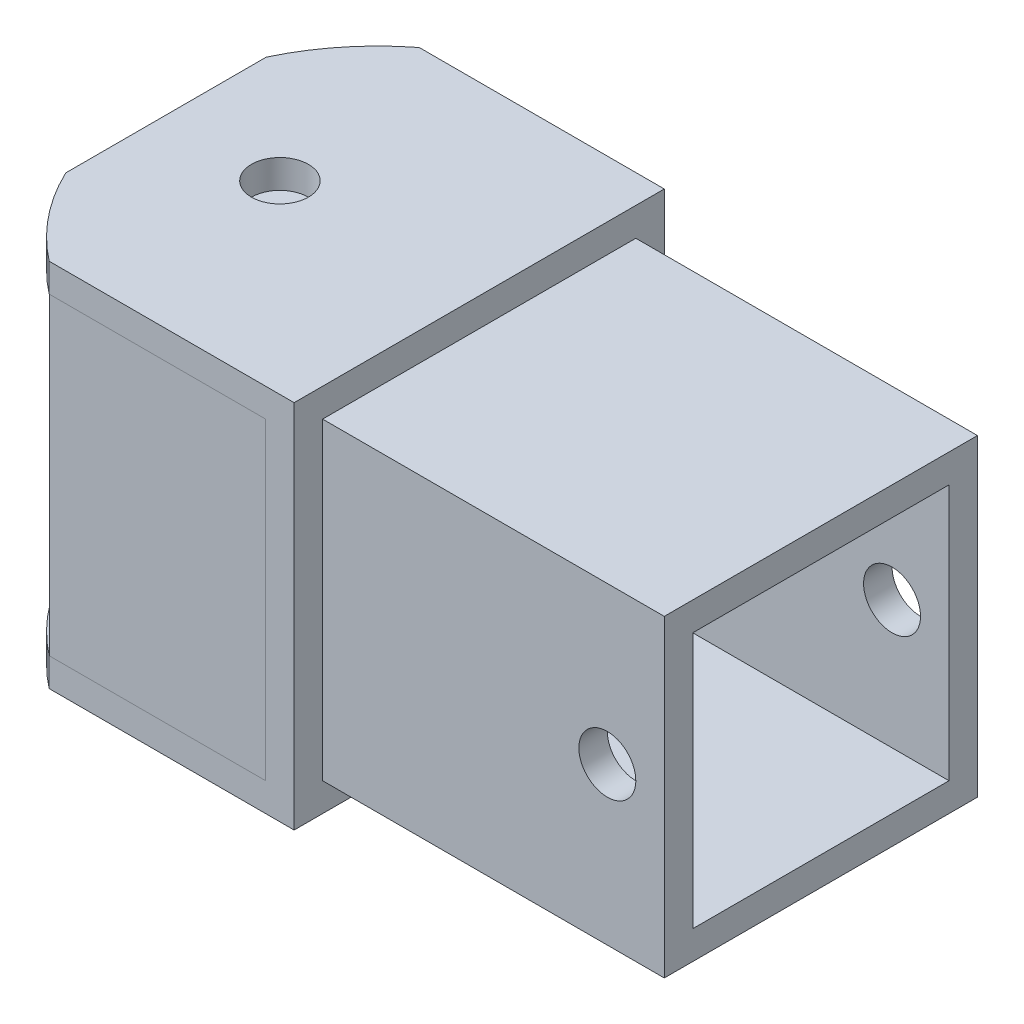
ISO-10303-21;
HEADER;
FILE_DESCRIPTION(('STEP AP214'),'2;1');
FILE_NAME('part.step','',(''),(''),'','','');
FILE_SCHEMA(('AUTOMOTIVE_DESIGN { 1 0 10303 214 1 1 1 1 }'));
ENDSEC;
DATA;
#1=APPLICATION_CONTEXT('core data for automotive mechanical design processes');
#2=APPLICATION_PROTOCOL_DEFINITION('international standard','automotive_design',2000,#1);
#3=PRODUCT_CONTEXT('',#1,'mechanical');
#4=PRODUCT('Part','Part','',(#3));
#5=PRODUCT_RELATED_PRODUCT_CATEGORY('part','',(#4));
#6=PRODUCT_DEFINITION_FORMATION('','',#4);
#7=PRODUCT_DEFINITION_CONTEXT('part definition',#1,'design');
#8=PRODUCT_DEFINITION('design','',#6,#7);
#9=PRODUCT_DEFINITION_SHAPE('','',#8);
#10=(LENGTH_UNIT() NAMED_UNIT(*) SI_UNIT(.MILLI.,.METRE.));
#11=(NAMED_UNIT(*) PLANE_ANGLE_UNIT() SI_UNIT($,.RADIAN.));
#12=(NAMED_UNIT(*) SI_UNIT($,.STERADIAN.) SOLID_ANGLE_UNIT());
#13=UNCERTAINTY_MEASURE_WITH_UNIT(LENGTH_MEASURE(1.E-05),#10,'distance_accuracy_value','');
#14=(GEOMETRIC_REPRESENTATION_CONTEXT(3) GLOBAL_UNCERTAINTY_ASSIGNED_CONTEXT((#13)) GLOBAL_UNIT_ASSIGNED_CONTEXT((#10,
#11,#12)) REPRESENTATION_CONTEXT('',''));
#15=CARTESIAN_POINT('',(0.,0.,0.));
#16=DIRECTION('',(0.,0.,1.));
#17=DIRECTION('',(1.,0.,0.));
#18=AXIS2_PLACEMENT_3D('',#15,#16,#17);
#19=CARTESIAN_POINT('',(-50.8,82.5502499999997,114.30025));
#20=DIRECTION('',(1.,0.,0.));
#21=DIRECTION('',(0.,1.,0.));
#22=AXIS2_PLACEMENT_3D('',#19,#20,#21);
#23=PLANE('',#22);
#24=DIRECTION('',(0.,-1.,0.));
#25=VECTOR('',#24,1.);
#26=CARTESIAN_POINT('',(-50.8,82.5502499999997,76.4548080116448));
#27=LINE('',#26,#25);
#28=CARTESIAN_POINT('',(-50.8,82.5502499999999,76.4548080116448));
#29=VERTEX_POINT('',#28);
#30=CARTESIAN_POINT('',(-50.8,69.8502499999999,76.4548080116448));
#31=VERTEX_POINT('',#30);
#32=EDGE_CURVE('P0_E204',#29,#31,#27,.T.);
#33=ORIENTED_EDGE('',*,*,#32,.F.);
#34=DIRECTION('',(0.,0.,-1.));
#35=VECTOR('',#34,1.);
#36=CARTESIAN_POINT('',(-50.8,82.5502499999997,114.30025));
#37=LINE('',#36,#35);
#38=CARTESIAN_POINT('',(-50.8,82.5502500000002,-12.9543080116442));
#39=VERTEX_POINT('',#38);
#40=EDGE_CURVE('P0_E171',#29,#39,#37,.T.);
#41=ORIENTED_EDGE('',*,*,#40,.T.);
#42=DIRECTION('',(0.,-1.,0.));
#43=VECTOR('',#42,1.);
#44=CARTESIAN_POINT('',(-50.8,82.55025,-12.9543080116442));
#45=LINE('',#44,#43);
#46=CARTESIAN_POINT('',(-50.8,69.8502500000002,-12.9543080116443));
#47=VERTEX_POINT('',#46);
#48=EDGE_CURVE('P0_E262',#47,#39,#45,.F.);
#49=ORIENTED_EDGE('',*,*,#48,.F.);
#50=DIRECTION('',(0.,0.,-1.));
#51=VECTOR('',#50,1.);
#52=CARTESIAN_POINT('',(-50.8,69.8502499999997,114.30025));
#53=LINE('',#52,#51);
#54=EDGE_CURVE('P0_E26',#31,#47,#53,.T.);
#55=ORIENTED_EDGE('',*,*,#54,.F.);
#56=EDGE_LOOP('',(#33,#41,#49,#55));
#57=FACE_BOUND('',#56,.T.);
#58=ADVANCED_FACE('P0_F17',(#57),#23,.F.);
#59=CARTESIAN_POINT('',(-50.8,69.8502499999997,114.30025));
#60=DIRECTION('',(0.,1.,0.));
#61=DIRECTION('',(-1.,0.,0.));
#62=AXIS2_PLACEMENT_3D('',#59,#60,#61);
#63=PLANE('',#62);
#64=CARTESIAN_POINT('',(0.,69.85025,31.7502500000002));
#65=DIRECTION('',(0.,1.,0.));
#66=DIRECTION('',(-1.,0.,0.));
#67=AXIS2_PLACEMENT_3D('',#64,#65,#66);
#68=CIRCLE('',#67,12.7);
#69=CARTESIAN_POINT('',(-12.7,69.85025,31.7502500000002));
#70=VERTEX_POINT('',#69);
#71=EDGE_CURVE('P0_E282',#70,#70,#68,.T.);
#72=ORIENTED_EDGE('',*,*,#71,.T.);
#73=EDGE_LOOP('',(#72));
#74=FACE_BOUND('',#73,.T.);
#75=CARTESIAN_POINT('',(43.5564957867523,69.85025,31.7502500000002));
#76=DIRECTION('',(0.,1.,0.));
#77=DIRECTION('',(-1.,0.,0.));
#78=AXIS2_PLACEMENT_3D('',#75,#76,#77);
#79=CIRCLE('',#78,104.410946764082);
#80=CARTESIAN_POINT('',(-20.3742738329848,69.8502499999997,114.30025));
#81=VERTEX_POINT('',#80);
#82=EDGE_CURVE('P0_E42',#31,#81,#79,.T.);
#83=ORIENTED_EDGE('',*,*,#82,.F.);
#84=ORIENTED_EDGE('',*,*,#54,.T.);
#85=CARTESIAN_POINT('',(-20.3742738329847,69.8502500000003,-50.7997499999997));
#86=VERTEX_POINT('',#85);
#87=EDGE_CURVE('P0_E260',#86,#47,#79,.T.);
#88=ORIENTED_EDGE('',*,*,#87,.F.);
#89=DIRECTION('',(1.,0.,0.));
#90=VECTOR('',#89,1.);
#91=CARTESIAN_POINT('',(-50.8,69.8502500000003,-50.7997499999997));
#92=LINE('',#91,#90);
#93=CARTESIAN_POINT('',(76.2,69.8502500000003,-50.7997499999997));
#94=VERTEX_POINT('',#93);
#95=EDGE_CURVE('P0_E184',#86,#94,#92,.T.);
#96=ORIENTED_EDGE('',*,*,#95,.T.);
#97=DIRECTION('',(0.,0.,-1.));
#98=VECTOR('',#97,1.);
#99=CARTESIAN_POINT('',(76.2,69.8502499999997,114.30025));
#100=LINE('',#99,#98);
#101=CARTESIAN_POINT('',(76.2,69.8502499999997,114.30025));
#102=VERTEX_POINT('',#101);
#103=EDGE_CURVE('P0_E207',#102,#94,#100,.T.);
#104=ORIENTED_EDGE('',*,*,#103,.F.);
#105=DIRECTION('',(1.,0.,0.));
#106=VECTOR('',#105,1.);
#107=CARTESIAN_POINT('',(-50.8,69.8502499999997,114.30025));
#108=LINE('',#107,#106);
#109=EDGE_CURVE('P0_E224',#81,#102,#108,.T.);
#110=ORIENTED_EDGE('',*,*,#109,.F.);
#111=EDGE_LOOP('',(#83,#84,#88,#96,#104,#110));
#112=FACE_BOUND('',#111,.T.);
#113=ADVANCED_FACE('P0_F370',(#74,#112),#63,.F.);
#114=CARTESIAN_POINT('',(76.2,-69.8497500000003,114.30025));
#115=DIRECTION('',(0.,-1.,0.));
#116=DIRECTION('',(1.,0.,0.));
#117=AXIS2_PLACEMENT_3D('',#114,#115,#116);
#118=PLANE('',#117);
#119=CARTESIAN_POINT('',(0.,-69.84975,31.7502499999998));
#120=DIRECTION('',(0.,-1.,0.));
#121=DIRECTION('',(1.,0.,0.));
#122=AXIS2_PLACEMENT_3D('',#119,#120,#121);
#123=CIRCLE('',#122,12.7);
#124=CARTESIAN_POINT('',(12.7,-69.84975,31.7502499999998));
#125=VERTEX_POINT('',#124);
#126=EDGE_CURVE('P0_E279',#125,#125,#123,.T.);
#127=ORIENTED_EDGE('',*,*,#126,.T.);
#128=EDGE_LOOP('',(#127));
#129=FACE_BOUND('',#128,.T.);
#130=CARTESIAN_POINT('',(43.5564957867523,-69.84975,31.7502499999998));
#131=DIRECTION('',(0.,-1.,0.));
#132=DIRECTION('',(1.,0.,0.));
#133=AXIS2_PLACEMENT_3D('',#130,#131,#132);
#134=CIRCLE('',#133,104.410946764082);
#135=CARTESIAN_POINT('',(-20.3742738329847,-69.8497500000003,114.30025));
#136=VERTEX_POINT('',#135);
#137=CARTESIAN_POINT('',(-50.7999999999997,-69.8497500000001,76.4548080116449));
#138=VERTEX_POINT('',#137);
#139=EDGE_CURVE('P0_E259',#136,#138,#134,.T.);
#140=ORIENTED_EDGE('',*,*,#139,.F.);
#141=DIRECTION('',(-1.,0.,0.));
#142=VECTOR('',#141,1.);
#143=CARTESIAN_POINT('',(76.2,-69.8497500000003,114.30025));
#144=LINE('',#143,#142);
#145=CARTESIAN_POINT('',(76.2,-69.8497500000003,114.30025));
#146=VERTEX_POINT('',#145);
#147=EDGE_CURVE('P0_E348',#146,#136,#144,.T.);
#148=ORIENTED_EDGE('',*,*,#147,.F.);
#149=DIRECTION('',(0.,0.,-1.));
#150=VECTOR('',#149,1.);
#151=CARTESIAN_POINT('',(76.2,-69.8497500000003,114.30025));
#152=LINE('',#151,#150);
#153=CARTESIAN_POINT('',(76.2,-69.8497499999997,-50.7997500000002));
#154=VERTEX_POINT('',#153);
#155=EDGE_CURVE('P0_E210',#146,#154,#152,.T.);
#156=ORIENTED_EDGE('',*,*,#155,.T.);
#157=DIRECTION('',(-1.,0.,0.));
#158=VECTOR('',#157,1.);
#159=CARTESIAN_POINT('',(76.2,-69.8497499999997,-50.7997500000002));
#160=LINE('',#159,#158);
#161=CARTESIAN_POINT('',(-20.3742738329848,-69.8497499999997,-50.7997500000002));
#162=VERTEX_POINT('',#161);
#163=EDGE_CURVE('P0_E189',#154,#162,#160,.T.);
#164=ORIENTED_EDGE('',*,*,#163,.T.);
#165=CARTESIAN_POINT('',(-50.7999999999997,-69.8497499999998,-12.9543080116454));
#166=VERTEX_POINT('',#165);
#167=EDGE_CURVE('P0_E257',#166,#162,#134,.T.);
#168=ORIENTED_EDGE('',*,*,#167,.F.);
#169=DIRECTION('',(0.,0.,-1.));
#170=VECTOR('',#169,1.);
#171=CARTESIAN_POINT('',(-50.8,-69.8497500000003,114.30025));
#172=LINE('',#171,#170);
#173=EDGE_CURVE('P0_E213',#138,#166,#172,.T.);
#174=ORIENTED_EDGE('',*,*,#173,.F.);
#175=EDGE_LOOP('',(#140,#148,#156,#164,#168,#174));
#176=FACE_BOUND('',#175,.T.);
#177=ADVANCED_FACE('P0_F362',(#129,#176),#118,.F.);
#178=CARTESIAN_POINT('',(-50.8,-69.8497500000003,114.30025));
#179=DIRECTION('',(1.,0.,0.));
#180=DIRECTION('',(0.,1.,0.));
#181=AXIS2_PLACEMENT_3D('',#178,#179,#180);
#182=PLANE('',#181);
#183=DIRECTION('',(0.,-1.,0.));
#184=VECTOR('',#183,1.);
#185=CARTESIAN_POINT('',(-50.7999999999997,82.55025,76.4548080116454));
#186=LINE('',#185,#184);
#187=CARTESIAN_POINT('',(-50.8,-82.5497500000001,76.4548080116443));
#188=VERTEX_POINT('',#187);
#189=EDGE_CURVE('P0_E256',#138,#188,#186,.T.);
#190=ORIENTED_EDGE('',*,*,#189,.F.);
#191=ORIENTED_EDGE('',*,*,#173,.T.);
#192=DIRECTION('',(0.,-1.,0.));
#193=VECTOR('',#192,1.);
#194=CARTESIAN_POINT('',(-50.7999999999997,82.5502500000003,-12.9543080116448));
#195=LINE('',#194,#193);
#196=CARTESIAN_POINT('',(-50.8,-82.5497499999998,-12.9543080116448));
#197=VERTEX_POINT('',#196);
#198=EDGE_CURVE('P0_E249',#197,#166,#195,.F.);
#199=ORIENTED_EDGE('',*,*,#198,.F.);
#200=DIRECTION('',(0.,0.,-1.));
#201=VECTOR('',#200,1.);
#202=CARTESIAN_POINT('',(-50.8,-82.5497500000003,114.30025));
#203=LINE('',#202,#201);
#204=EDGE_CURVE('P0_E216',#188,#197,#203,.T.);
#205=ORIENTED_EDGE('',*,*,#204,.F.);
#206=EDGE_LOOP('',(#190,#191,#199,#205));
#207=FACE_BOUND('',#206,.T.);
#208=ADVANCED_FACE('P0_F386',(#207),#182,.F.);
#209=CARTESIAN_POINT('',(-50.8,-82.5497500000003,114.30025));
#210=DIRECTION('',(0.,1.,0.));
#211=DIRECTION('',(-1.,0.,0.));
#212=AXIS2_PLACEMENT_3D('',#209,#210,#211);
#213=PLANE('',#212);
#214=CARTESIAN_POINT('',(0.,-82.54975,31.7502499999997));
#215=DIRECTION('',(0.,1.,0.));
#216=DIRECTION('',(-1.,0.,0.));
#217=AXIS2_PLACEMENT_3D('',#214,#215,#216);
#218=CIRCLE('',#217,12.7);
#219=CARTESIAN_POINT('',(-12.7,-82.54975,31.7502499999997));
#220=VERTEX_POINT('',#219);
#221=EDGE_CURVE('P0_E276',#220,#220,#218,.T.);
#222=ORIENTED_EDGE('',*,*,#221,.T.);
#223=EDGE_LOOP('',(#222));
#224=FACE_BOUND('',#223,.T.);
#225=CARTESIAN_POINT('',(43.5564957867523,-82.54975,31.7502499999997));
#226=DIRECTION('',(0.,1.,0.));
#227=DIRECTION('',(-1.,0.,0.));
#228=AXIS2_PLACEMENT_3D('',#225,#226,#227);
#229=CIRCLE('',#228,104.410946764082);
#230=CARTESIAN_POINT('',(-20.3742738329848,-82.5497500000003,114.30025));
#231=VERTEX_POINT('',#230);
#232=EDGE_CURVE('P0_E34',#188,#231,#229,.T.);
#233=ORIENTED_EDGE('',*,*,#232,.F.);
#234=ORIENTED_EDGE('',*,*,#204,.T.);
#235=CARTESIAN_POINT('',(-20.3742738329847,-82.5497499999997,-50.7997500000003));
#236=VERTEX_POINT('',#235);
#237=EDGE_CURVE('P0_E160',#236,#197,#229,.T.);
#238=ORIENTED_EDGE('',*,*,#237,.F.);
#239=DIRECTION('',(1.,0.,0.));
#240=VECTOR('',#239,1.);
#241=CARTESIAN_POINT('',(-50.8,-82.5497499999997,-50.7997500000003));
#242=LINE('',#241,#240);
#243=CARTESIAN_POINT('',(88.9000000000001,-82.5497499999997,-50.7997500000003));
#244=VERTEX_POINT('',#243);
#245=EDGE_CURVE('P0_E192',#236,#244,#242,.T.);
#246=ORIENTED_EDGE('',*,*,#245,.T.);
#247=DIRECTION('',(0.,0.,-1.));
#248=VECTOR('',#247,1.);
#249=CARTESIAN_POINT('',(88.9000000000001,-82.5497500000003,114.30025));
#250=LINE('',#249,#248);
#251=CARTESIAN_POINT('',(88.9000000000001,-82.5497500000003,114.30025));
#252=VERTEX_POINT('',#251);
#253=EDGE_CURVE('P0_E219',#252,#244,#250,.T.);
#254=ORIENTED_EDGE('',*,*,#253,.F.);
#255=DIRECTION('',(1.,0.,0.));
#256=VECTOR('',#255,1.);
#257=CARTESIAN_POINT('',(-50.8,-82.5497500000003,114.30025));
#258=LINE('',#257,#256);
#259=EDGE_CURVE('P0_E20',#231,#252,#258,.T.);
#260=ORIENTED_EDGE('',*,*,#259,.F.);
#261=EDGE_LOOP('',(#233,#234,#238,#246,#254,#260));
#262=FACE_BOUND('',#261,.T.);
#263=ADVANCED_FACE('P0_F354',(#224,#262),#213,.F.);
#264=CARTESIAN_POINT('',(88.9,82.5502499999997,114.30025));
#265=DIRECTION('',(0.,-1.,0.));
#266=DIRECTION('',(1.,0.,0.));
#267=AXIS2_PLACEMENT_3D('',#264,#265,#266);
#268=PLANE('',#267);
#269=CARTESIAN_POINT('',(0.,82.55025,31.7502500000003));
#270=DIRECTION('',(0.,-1.,0.));
#271=DIRECTION('',(1.,0.,0.));
#272=AXIS2_PLACEMENT_3D('',#269,#270,#271);
#273=CIRCLE('',#272,12.7);
#274=CARTESIAN_POINT('',(12.7,82.55025,31.7502500000003));
#275=VERTEX_POINT('',#274);
#276=EDGE_CURVE('P0_E273',#275,#275,#273,.T.);
#277=ORIENTED_EDGE('',*,*,#276,.T.);
#278=EDGE_LOOP('',(#277));
#279=FACE_BOUND('',#278,.T.);
#280=CARTESIAN_POINT('',(43.5564957867523,82.55025,31.7502500000003));
#281=DIRECTION('',(0.,-1.,0.));
#282=DIRECTION('',(1.,0.,0.));
#283=AXIS2_PLACEMENT_3D('',#280,#281,#282);
#284=CIRCLE('',#283,104.410946764082);
#285=CARTESIAN_POINT('',(-20.3742738329847,82.5502499999997,114.30025));
#286=VERTEX_POINT('',#285);
#287=EDGE_CURVE('P0_E155',#286,#29,#284,.T.);
#288=ORIENTED_EDGE('',*,*,#287,.F.);
#289=DIRECTION('',(-1.,0.,0.));
#290=VECTOR('',#289,1.);
#291=CARTESIAN_POINT('',(88.9,82.5502499999997,114.30025));
#292=LINE('',#291,#290);
#293=CARTESIAN_POINT('',(88.9,82.5502499999997,114.30025));
#294=VERTEX_POINT('',#293);
#295=EDGE_CURVE('P0_E168',#294,#286,#292,.T.);
#296=ORIENTED_EDGE('',*,*,#295,.F.);
#297=DIRECTION('',(0.,0.,-1.));
#298=VECTOR('',#297,1.);
#299=CARTESIAN_POINT('',(88.9,82.5502499999997,114.30025));
#300=LINE('',#299,#298);
#301=CARTESIAN_POINT('',(88.9,82.5502500000003,-50.7997499999997));
#302=VERTEX_POINT('',#301);
#303=EDGE_CURVE('P0_E180',#294,#302,#300,.T.);
#304=ORIENTED_EDGE('',*,*,#303,.T.);
#305=DIRECTION('',(-1.,0.,0.));
#306=VECTOR('',#305,1.);
#307=CARTESIAN_POINT('',(88.9,82.5502500000003,-50.7997499999997));
#308=LINE('',#307,#306);
#309=CARTESIAN_POINT('',(-20.3742738329847,82.5502500000003,-50.7997499999997));
#310=VERTEX_POINT('',#309);
#311=EDGE_CURVE('P0_E222',#302,#310,#308,.T.);
#312=ORIENTED_EDGE('',*,*,#311,.T.);
#313=EDGE_CURVE('P0_E173',#39,#310,#284,.T.);
#314=ORIENTED_EDGE('',*,*,#313,.F.);
#315=ORIENTED_EDGE('',*,*,#40,.F.);
#316=EDGE_LOOP('',(#288,#296,#304,#312,#314,#315));
#317=FACE_BOUND('',#316,.T.);
#318=ADVANCED_FACE('P0_F166',(#279,#317),#268,.F.);
#319=CARTESIAN_POINT('',(0.,31.7502499999997,114.30025));
#320=DIRECTION('',(0.,0.,1.));
#321=DIRECTION('',(0.,-1.,0.));
#322=AXIS2_PLACEMENT_3D('',#319,#320,#321);
#323=PLANE('',#322);
#324=ORIENTED_EDGE('',*,*,#295,.T.);
#325=DIRECTION('',(0.,-1.,0.));
#326=VECTOR('',#325,1.);
#327=CARTESIAN_POINT('',(-20.3742738329847,82.5502499999997,114.30025));
#328=LINE('',#327,#326);
#329=EDGE_CURVE('P0_E152',#286,#81,#328,.T.);
#330=ORIENTED_EDGE('',*,*,#329,.T.);
#331=ORIENTED_EDGE('',*,*,#109,.T.);
#332=DIRECTION('',(0.,-1.,0.));
#333=VECTOR('',#332,1.);
#334=CARTESIAN_POINT('',(76.2,69.8502499999997,114.30025));
#335=LINE('',#334,#333);
#336=EDGE_CURVE('P0_E226',#102,#146,#335,.T.);
#337=ORIENTED_EDGE('',*,*,#336,.T.);
#338=ORIENTED_EDGE('',*,*,#147,.T.);
#339=EDGE_CURVE('P0_E161',#136,#231,#328,.T.);
#340=ORIENTED_EDGE('',*,*,#339,.T.);
#341=ORIENTED_EDGE('',*,*,#259,.T.);
#342=DIRECTION('',(0.,1.,0.));
#343=VECTOR('',#342,1.);
#344=CARTESIAN_POINT('',(88.9000000000001,-82.5497500000003,114.30025));
#345=LINE('',#344,#343);
#346=EDGE_CURVE('P0_E177',#252,#294,#345,.T.);
#347=ORIENTED_EDGE('',*,*,#346,.T.);
#348=EDGE_LOOP('',(#324,#330,#331,#337,#338,#340,#341,#347));
#349=FACE_BOUND('',#348,.T.);
#350=ADVANCED_FACE('P0_F175',(#349),#323,.T.);
#351=CARTESIAN_POINT('',(0.,31.7502500000003,-50.7997499999999));
#352=DIRECTION('',(0.,0.,1.));
#353=DIRECTION('',(0.,-1.,0.));
#354=AXIS2_PLACEMENT_3D('',#351,#352,#353);
#355=PLANE('',#354);
#356=DIRECTION('',(0.,-1.,0.));
#357=VECTOR('',#356,1.);
#358=CARTESIAN_POINT('',(-20.3742738329847,82.5502500000003,-50.7997499999997));
#359=LINE('',#358,#357);
#360=EDGE_CURVE('P0_E172',#310,#86,#359,.T.);
#361=ORIENTED_EDGE('',*,*,#360,.F.);
#362=ORIENTED_EDGE('',*,*,#311,.F.);
#363=DIRECTION('',(0.,1.,0.));
#364=VECTOR('',#363,1.);
#365=CARTESIAN_POINT('',(88.9000000000001,-82.5497499999997,-50.7997500000003));
#366=LINE('',#365,#364);
#367=EDGE_CURVE('P0_E195',#244,#302,#366,.T.);
#368=ORIENTED_EDGE('',*,*,#367,.F.);
#369=ORIENTED_EDGE('',*,*,#245,.F.);
#370=DIRECTION('',(0.,-1.,0.));
#371=VECTOR('',#370,1.);
#372=CARTESIAN_POINT('',(-20.3742738329848,82.5502500000003,-50.7997499999997));
#373=LINE('',#372,#371);
#374=EDGE_CURVE('P0_E11',#162,#236,#373,.T.);
#375=ORIENTED_EDGE('',*,*,#374,.F.);
#376=ORIENTED_EDGE('',*,*,#163,.F.);
#377=DIRECTION('',(0.,-1.,0.));
#378=VECTOR('',#377,1.);
#379=CARTESIAN_POINT('',(76.2,69.8502500000003,-50.7997499999997));
#380=LINE('',#379,#378);
#381=EDGE_CURVE('P0_E186',#94,#154,#380,.T.);
#382=ORIENTED_EDGE('',*,*,#381,.F.);
#383=ORIENTED_EDGE('',*,*,#95,.F.);
#384=EDGE_LOOP('',(#361,#362,#368,#369,#375,#376,#382,#383));
#385=FACE_BOUND('',#384,.T.);
#386=ADVANCED_FACE('P0_F236',(#385),#355,.F.);
#387=CARTESIAN_POINT('',(88.9000000000001,-82.5497500000003,114.30025));
#388=DIRECTION('',(-1.,0.,0.));
#389=DIRECTION('',(0.,-1.,0.));
#390=AXIS2_PLACEMENT_3D('',#387,#388,#389);
#391=PLANE('',#390);
#392=ORIENTED_EDGE('',*,*,#367,.T.);
#393=ORIENTED_EDGE('',*,*,#303,.F.);
#394=ORIENTED_EDGE('',*,*,#346,.F.);
#395=ORIENTED_EDGE('',*,*,#253,.T.);
#396=EDGE_LOOP('',(#392,#393,#394,#395));
#397=FACE_BOUND('',#396,.T.);
#398=DIRECTION('',(0.,0.,1.));
#399=VECTOR('',#398,1.);
#400=CARTESIAN_POINT('',(88.9,69.8502499999998,101.60025));
#401=LINE('',#400,#399);
#402=CARTESIAN_POINT('',(88.9,69.8502500000003,-38.0997499999997));
#403=VERTEX_POINT('',#402);
#404=CARTESIAN_POINT('',(88.9,69.8502499999997,101.60025));
#405=VERTEX_POINT('',#404);
#406=EDGE_CURVE('P0_E315',#403,#405,#401,.T.);
#407=ORIENTED_EDGE('',*,*,#406,.F.);
#408=DIRECTION('',(0.,1.,0.));
#409=VECTOR('',#408,1.);
#410=CARTESIAN_POINT('',(88.9,-69.8497499999997,-38.0997500000002));
#411=LINE('',#410,#409);
#412=CARTESIAN_POINT('',(88.9000000000001,-69.8497499999997,-38.0997500000002));
#413=VERTEX_POINT('',#412);
#414=EDGE_CURVE('P0_E320',#413,#403,#411,.T.);
#415=ORIENTED_EDGE('',*,*,#414,.F.);
#416=DIRECTION('',(0.,0.,-1.));
#417=VECTOR('',#416,1.);
#418=CARTESIAN_POINT('',(88.9,-69.8497500000002,101.60025));
#419=LINE('',#418,#417);
#420=CARTESIAN_POINT('',(88.9000000000001,-69.8497500000002,101.60025));
#421=VERTEX_POINT('',#420);
#422=EDGE_CURVE('P0_E332',#421,#413,#419,.T.);
#423=ORIENTED_EDGE('',*,*,#422,.F.);
#424=DIRECTION('',(0.,-1.,0.));
#425=VECTOR('',#424,1.);
#426=CARTESIAN_POINT('',(88.9,-69.8497500000002,101.60025));
#427=LINE('',#426,#425);
#428=EDGE_CURVE('P0_E329',#405,#421,#427,.T.);
#429=ORIENTED_EDGE('',*,*,#428,.F.);
#430=EDGE_LOOP('',(#407,#415,#423,#429));
#431=FACE_BOUND('',#430,.T.);
#432=ADVANCED_FACE('P0_F230',(#397,#431),#391,.F.);
#433=CARTESIAN_POINT('',(76.2,69.8502499999997,114.30025));
#434=DIRECTION('',(1.,0.,0.));
#435=DIRECTION('',(0.,1.,0.));
#436=AXIS2_PLACEMENT_3D('',#433,#434,#435);
#437=PLANE('',#436);
#438=ORIENTED_EDGE('',*,*,#381,.T.);
#439=ORIENTED_EDGE('',*,*,#155,.F.);
#440=ORIENTED_EDGE('',*,*,#336,.F.);
#441=ORIENTED_EDGE('',*,*,#103,.T.);
#442=EDGE_LOOP('',(#438,#439,#440,#441));
#443=FACE_BOUND('',#442,.T.);
#444=ADVANCED_FACE('P0_F367',(#443),#437,.F.);
#445=CARTESIAN_POINT('',(241.3,31.75025,31.7502500000001));
#446=DIRECTION('',(1.,0.,0.));
#447=DIRECTION('',(0.,1.,0.));
#448=AXIS2_PLACEMENT_3D('',#445,#446,#447);
#449=PLANE('',#448);
#450=DIRECTION('',(0.,0.,1.));
#451=VECTOR('',#450,1.);
#452=CARTESIAN_POINT('',(241.3,69.8502499999997,101.60025));
#453=LINE('',#452,#451);
#454=CARTESIAN_POINT('',(241.3,69.8502500000002,-38.0997499999997));
#455=VERTEX_POINT('',#454);
#456=CARTESIAN_POINT('',(241.3,69.8502499999997,101.60025));
#457=VERTEX_POINT('',#456);
#458=EDGE_CURVE('P0_E316',#455,#457,#453,.T.);
#459=ORIENTED_EDGE('',*,*,#458,.T.);
#460=DIRECTION('',(0.,-1.,0.));
#461=VECTOR('',#460,1.);
#462=CARTESIAN_POINT('',(241.3,-69.8497500000002,101.60025));
#463=LINE('',#462,#461);
#464=CARTESIAN_POINT('',(241.3,-69.8497500000002,101.60025));
#465=VERTEX_POINT('',#464);
#466=EDGE_CURVE('P0_E319',#457,#465,#463,.T.);
#467=ORIENTED_EDGE('',*,*,#466,.T.);
#468=DIRECTION('',(0.,0.,-1.));
#469=VECTOR('',#468,1.);
#470=CARTESIAN_POINT('',(241.3,-69.8497500000002,101.60025));
#471=LINE('',#470,#469);
#472=CARTESIAN_POINT('',(241.3,-69.8497499999997,-38.0997500000002));
#473=VERTEX_POINT('',#472);
#474=EDGE_CURVE('P0_E322',#465,#473,#471,.T.);
#475=ORIENTED_EDGE('',*,*,#474,.T.);
#476=DIRECTION('',(0.,1.,0.));
#477=VECTOR('',#476,1.);
#478=CARTESIAN_POINT('',(241.3,-69.8497499999997,-38.0997500000002));
#479=LINE('',#478,#477);
#480=EDGE_CURVE('P0_E324',#473,#455,#479,.T.);
#481=ORIENTED_EDGE('',*,*,#480,.T.);
#482=EDGE_LOOP('',(#459,#467,#475,#481));
#483=FACE_BOUND('',#482,.T.);
#484=DIRECTION('',(0.,-1.,0.));
#485=VECTOR('',#484,1.);
#486=CARTESIAN_POINT('',(241.3,-57.1497500000002,88.9002499999999));
#487=LINE('',#486,#485);
#488=CARTESIAN_POINT('',(241.3,57.1502499999998,88.9002500000003));
#489=VERTEX_POINT('',#488);
#490=CARTESIAN_POINT('',(241.3,-57.1497500000002,88.9002499999999));
#491=VERTEX_POINT('',#490);
#492=EDGE_CURVE('P0_E288',#489,#491,#487,.T.);
#493=ORIENTED_EDGE('',*,*,#492,.F.);
#494=DIRECTION('',(0.,0.,1.));
#495=VECTOR('',#494,1.);
#496=CARTESIAN_POINT('',(241.3,57.1502499999998,88.9002500000003));
#497=LINE('',#496,#495);
#498=CARTESIAN_POINT('',(241.3,57.1502500000002,-25.3997499999998));
#499=VERTEX_POINT('',#498);
#500=EDGE_CURVE('P0_E286',#499,#489,#497,.T.);
#501=ORIENTED_EDGE('',*,*,#500,.F.);
#502=DIRECTION('',(0.,1.,0.));
#503=VECTOR('',#502,1.);
#504=CARTESIAN_POINT('',(241.3,-57.1497499999998,-25.3997500000002));
#505=LINE('',#504,#503);
#506=CARTESIAN_POINT('',(241.3,-57.1497499999998,-25.3997500000002));
#507=VERTEX_POINT('',#506);
#508=EDGE_CURVE('P0_E294',#507,#499,#505,.T.);
#509=ORIENTED_EDGE('',*,*,#508,.F.);
#510=DIRECTION('',(0.,0.,-1.));
#511=VECTOR('',#510,1.);
#512=CARTESIAN_POINT('',(241.3,-57.1497500000002,88.9002499999999));
#513=LINE('',#512,#511);
#514=EDGE_CURVE('P0_E291',#491,#507,#513,.T.);
#515=ORIENTED_EDGE('',*,*,#514,.F.);
#516=EDGE_LOOP('',(#493,#501,#509,#515));
#517=FACE_BOUND('',#516,.T.);
#518=ADVANCED_FACE('P0_F391',(#483,#517),#449,.T.);
#519=CARTESIAN_POINT('',(241.3,69.8502499999997,101.60025));
#520=DIRECTION('',(0.,-1.,0.));
#521=DIRECTION('',(1.,0.,0.));
#522=AXIS2_PLACEMENT_3D('',#519,#520,#521);
#523=PLANE('',#522);
#524=ORIENTED_EDGE('',*,*,#406,.T.);
#525=DIRECTION('',(-1.,0.,0.));
#526=VECTOR('',#525,1.);
#527=CARTESIAN_POINT('',(241.3,69.8502499999997,101.60025));
#528=LINE('',#527,#526);
#529=EDGE_CURVE('P0_E187',#457,#405,#528,.T.);
#530=ORIENTED_EDGE('',*,*,#529,.F.);
#531=ORIENTED_EDGE('',*,*,#458,.F.);
#532=DIRECTION('',(-1.,0.,0.));
#533=VECTOR('',#532,1.);
#534=CARTESIAN_POINT('',(241.3,69.8502500000002,-38.0997499999997));
#535=LINE('',#534,#533);
#536=EDGE_CURVE('P0_E326',#455,#403,#535,.T.);
#537=ORIENTED_EDGE('',*,*,#536,.T.);
#538=EDGE_LOOP('',(#524,#530,#531,#537));
#539=FACE_BOUND('',#538,.T.);
#540=ADVANCED_FACE('P0_F412',(#539),#523,.F.);
#541=CARTESIAN_POINT('',(241.3,-69.8497500000002,101.60025));
#542=DIRECTION('',(0.,0.,-1.));
#543=DIRECTION('',(0.,1.,0.));
#544=AXIS2_PLACEMENT_3D('',#541,#542,#543);
#545=PLANE('',#544);
#546=CARTESIAN_POINT('',(215.9,0.000249999999757389,101.60025));
#547=DIRECTION('',(0.,0.,-1.));
#548=DIRECTION('',(0.,1.,0.));
#549=AXIS2_PLACEMENT_3D('',#546,#547,#548);
#550=CIRCLE('',#549,12.7);
#551=CARTESIAN_POINT('',(215.9,12.7002499999998,101.60025));
#552=VERTEX_POINT('',#551);
#553=EDGE_CURVE('P0_E270',#552,#552,#550,.T.);
#554=ORIENTED_EDGE('',*,*,#553,.T.);
#555=EDGE_LOOP('',(#554));
#556=FACE_BOUND('',#555,.T.);
#557=ORIENTED_EDGE('',*,*,#428,.T.);
#558=DIRECTION('',(-1.,0.,0.));
#559=VECTOR('',#558,1.);
#560=CARTESIAN_POINT('',(241.3,-69.8497500000002,101.60025));
#561=LINE('',#560,#559);
#562=EDGE_CURVE('P0_E342',#465,#421,#561,.T.);
#563=ORIENTED_EDGE('',*,*,#562,.F.);
#564=ORIENTED_EDGE('',*,*,#466,.F.);
#565=ORIENTED_EDGE('',*,*,#529,.T.);
#566=EDGE_LOOP('',(#557,#563,#564,#565));
#567=FACE_BOUND('',#566,.T.);
#568=ADVANCED_FACE('P0_F415',(#556,#567),#545,.F.);
#569=CARTESIAN_POINT('',(241.3,-69.8497500000002,101.60025));
#570=DIRECTION('',(0.,1.,0.));
#571=DIRECTION('',(-1.,0.,0.));
#572=AXIS2_PLACEMENT_3D('',#569,#570,#571);
#573=PLANE('',#572);
#574=ORIENTED_EDGE('',*,*,#422,.T.);
#575=DIRECTION('',(-1.,0.,0.));
#576=VECTOR('',#575,1.);
#577=CARTESIAN_POINT('',(241.3,-69.8497499999997,-38.0997500000002));
#578=LINE('',#577,#576);
#579=EDGE_CURVE('P0_E339',#473,#413,#578,.T.);
#580=ORIENTED_EDGE('',*,*,#579,.F.);
#581=ORIENTED_EDGE('',*,*,#474,.F.);
#582=ORIENTED_EDGE('',*,*,#562,.T.);
#583=EDGE_LOOP('',(#574,#580,#581,#582));
#584=FACE_BOUND('',#583,.T.);
#585=ADVANCED_FACE('P0_F419',(#584),#573,.F.);
#586=CARTESIAN_POINT('',(241.3,-69.8497499999997,-38.0997500000002));
#587=DIRECTION('',(0.,0.,1.));
#588=DIRECTION('',(0.,-1.,0.));
#589=AXIS2_PLACEMENT_3D('',#586,#587,#588);
#590=PLANE('',#589);
#591=CARTESIAN_POINT('',(215.9,0.000250000000243111,-38.0997499999999));
#592=DIRECTION('',(0.,0.,1.));
#593=DIRECTION('',(0.,-1.,0.));
#594=AXIS2_PLACEMENT_3D('',#591,#592,#593);
#595=CIRCLE('',#594,12.7);
#596=CARTESIAN_POINT('',(215.9,-12.6997499999998,-38.09975));
#597=VERTEX_POINT('',#596);
#598=EDGE_CURVE('P0_E267',#597,#597,#595,.T.);
#599=ORIENTED_EDGE('',*,*,#598,.T.);
#600=EDGE_LOOP('',(#599));
#601=FACE_BOUND('',#600,.T.);
#602=ORIENTED_EDGE('',*,*,#414,.T.);
#603=ORIENTED_EDGE('',*,*,#536,.F.);
#604=ORIENTED_EDGE('',*,*,#480,.F.);
#605=ORIENTED_EDGE('',*,*,#579,.T.);
#606=EDGE_LOOP('',(#602,#603,#604,#605));
#607=FACE_BOUND('',#606,.T.);
#608=ADVANCED_FACE('P0_F423',(#601,#607),#590,.F.);
#609=CARTESIAN_POINT('',(241.3,57.1502499999998,88.9002500000003));
#610=DIRECTION('',(0.,-1.,0.));
#611=DIRECTION('',(0.,0.,-1.));
#612=AXIS2_PLACEMENT_3D('',#609,#610,#611);
#613=PLANE('',#612);
#614=DIRECTION('',(0.,0.,1.));
#615=VECTOR('',#614,1.);
#616=CARTESIAN_POINT('',(88.9,57.1502499999998,88.9002500000003));
#617=LINE('',#616,#615);
#618=CARTESIAN_POINT('',(88.9,57.1502500000003,-25.3997499999998));
#619=VERTEX_POINT('',#618);
#620=CARTESIAN_POINT('',(88.9,57.1502499999998,88.9002500000003));
#621=VERTEX_POINT('',#620);
#622=EDGE_CURVE('P0_E285',#619,#621,#617,.T.);
#623=ORIENTED_EDGE('',*,*,#622,.F.);
#624=DIRECTION('',(-1.,0.,0.));
#625=VECTOR('',#624,1.);
#626=CARTESIAN_POINT('',(241.3,57.1502500000002,-25.3997499999998));
#627=LINE('',#626,#625);
#628=EDGE_CURVE('P0_E296',#499,#619,#627,.T.);
#629=ORIENTED_EDGE('',*,*,#628,.F.);
#630=ORIENTED_EDGE('',*,*,#500,.T.);
#631=DIRECTION('',(-1.,0.,0.));
#632=VECTOR('',#631,1.);
#633=CARTESIAN_POINT('',(241.3,57.1502499999998,88.9002500000003));
#634=LINE('',#633,#632);
#635=EDGE_CURVE('P0_E312',#489,#621,#634,.T.);
#636=ORIENTED_EDGE('',*,*,#635,.T.);
#637=EDGE_LOOP('',(#623,#629,#630,#636));
#638=FACE_BOUND('',#637,.T.);
#639=ADVANCED_FACE('P0_F427',(#638),#613,.T.);
#640=CARTESIAN_POINT('',(241.3,-57.1497500000002,88.9002499999999));
#641=DIRECTION('',(0.,0.,-1.));
#642=DIRECTION('',(0.,1.,0.));
#643=AXIS2_PLACEMENT_3D('',#640,#641,#642);
#644=PLANE('',#643);
#645=CARTESIAN_POINT('',(215.9,0.000249999999799022,88.90025));
#646=DIRECTION('',(0.,0.,-1.));
#647=DIRECTION('',(0.,1.,0.));
#648=AXIS2_PLACEMENT_3D('',#645,#646,#647);
#649=CIRCLE('',#648,12.7);
#650=CARTESIAN_POINT('',(215.9,12.7002499999998,88.9002500000001));
#651=VERTEX_POINT('',#650);
#652=EDGE_CURVE('P0_E203',#651,#651,#649,.T.);
#653=ORIENTED_EDGE('',*,*,#652,.F.);
#654=EDGE_LOOP('',(#653));
#655=FACE_BOUND('',#654,.T.);
#656=DIRECTION('',(0.,-1.,0.));
#657=VECTOR('',#656,1.);
#658=CARTESIAN_POINT('',(88.9,-57.1497500000002,88.9002499999999));
#659=LINE('',#658,#657);
#660=CARTESIAN_POINT('',(88.9,-57.1497500000002,88.9002499999999));
#661=VERTEX_POINT('',#660);
#662=EDGE_CURVE('P0_E299',#621,#661,#659,.T.);
#663=ORIENTED_EDGE('',*,*,#662,.F.);
#664=ORIENTED_EDGE('',*,*,#635,.F.);
#665=ORIENTED_EDGE('',*,*,#492,.T.);
#666=DIRECTION('',(-1.,0.,0.));
#667=VECTOR('',#666,1.);
#668=CARTESIAN_POINT('',(241.3,-57.1497500000002,88.9002499999999));
#669=LINE('',#668,#667);
#670=EDGE_CURVE('P0_E310',#491,#661,#669,.T.);
#671=ORIENTED_EDGE('',*,*,#670,.T.);
#672=EDGE_LOOP('',(#663,#664,#665,#671));
#673=FACE_BOUND('',#672,.T.);
#674=ADVANCED_FACE('P0_F434',(#655,#673),#644,.T.);
#675=CARTESIAN_POINT('',(241.3,-57.1497500000002,88.9002499999999));
#676=DIRECTION('',(0.,1.,0.));
#677=DIRECTION('',(0.,0.,1.));
#678=AXIS2_PLACEMENT_3D('',#675,#676,#677);
#679=PLANE('',#678);
#680=DIRECTION('',(0.,0.,-1.));
#681=VECTOR('',#680,1.);
#682=CARTESIAN_POINT('',(88.9,-57.1497500000002,88.9002499999999));
#683=LINE('',#682,#681);
#684=CARTESIAN_POINT('',(88.9,-57.1497499999998,-25.3997500000002));
#685=VERTEX_POINT('',#684);
#686=EDGE_CURVE('P0_E302',#661,#685,#683,.T.);
#687=ORIENTED_EDGE('',*,*,#686,.F.);
#688=ORIENTED_EDGE('',*,*,#670,.F.);
#689=ORIENTED_EDGE('',*,*,#514,.T.);
#690=DIRECTION('',(-1.,0.,0.));
#691=VECTOR('',#690,1.);
#692=CARTESIAN_POINT('',(241.3,-57.1497499999998,-25.3997500000002));
#693=LINE('',#692,#691);
#694=EDGE_CURVE('P0_E308',#507,#685,#693,.T.);
#695=ORIENTED_EDGE('',*,*,#694,.T.);
#696=EDGE_LOOP('',(#687,#688,#689,#695));
#697=FACE_BOUND('',#696,.T.);
#698=ADVANCED_FACE('P0_F438',(#697),#679,.T.);
#699=CARTESIAN_POINT('',(241.3,-57.1497499999998,-25.3997500000002));
#700=DIRECTION('',(0.,0.,1.));
#701=DIRECTION('',(0.,-1.,0.));
#702=AXIS2_PLACEMENT_3D('',#699,#700,#701);
#703=PLANE('',#702);
#704=CARTESIAN_POINT('',(215.9,0.000250000000201478,-25.39975));
#705=DIRECTION('',(0.,0.,1.));
#706=DIRECTION('',(0.,-1.,0.));
#707=AXIS2_PLACEMENT_3D('',#704,#705,#706);
#708=CIRCLE('',#707,12.7);
#709=CARTESIAN_POINT('',(215.9,-12.6997499999998,-25.39975));
#710=VERTEX_POINT('',#709);
#711=EDGE_CURVE('P0_E199',#710,#710,#708,.T.);
#712=ORIENTED_EDGE('',*,*,#711,.F.);
#713=EDGE_LOOP('',(#712));
#714=FACE_BOUND('',#713,.T.);
#715=DIRECTION('',(0.,1.,0.));
#716=VECTOR('',#715,1.);
#717=CARTESIAN_POINT('',(88.9,-57.1497499999998,-25.3997500000002));
#718=LINE('',#717,#716);
#719=EDGE_CURVE('P0_E289',#685,#619,#718,.T.);
#720=ORIENTED_EDGE('',*,*,#719,.F.);
#721=ORIENTED_EDGE('',*,*,#694,.F.);
#722=ORIENTED_EDGE('',*,*,#508,.T.);
#723=ORIENTED_EDGE('',*,*,#628,.T.);
#724=EDGE_LOOP('',(#720,#721,#722,#723));
#725=FACE_BOUND('',#724,.T.);
#726=ADVANCED_FACE('P0_F403',(#714,#725),#703,.T.);
#727=ORIENTED_EDGE('',*,*,#719,.T.);
#728=ORIENTED_EDGE('',*,*,#622,.T.);
#729=ORIENTED_EDGE('',*,*,#662,.T.);
#730=ORIENTED_EDGE('',*,*,#686,.T.);
#731=EDGE_LOOP('',(#727,#728,#729,#730));
#732=FACE_BOUND('',#731,.T.);
#733=ADVANCED_FACE('P0_F399',(#732),#391,.F.);
#734=CARTESIAN_POINT('',(0.,82.55025,31.7502500000003));
#735=DIRECTION('',(0.,-1.,0.));
#736=DIRECTION('',(1.,0.,0.));
#737=AXIS2_PLACEMENT_3D('',#734,#735,#736);
#738=CYLINDRICAL_SURFACE('',#737,12.7);
#739=ORIENTED_EDGE('',*,*,#276,.F.);
#740=EDGE_LOOP('',(#739));
#741=FACE_BOUND('',#740,.T.);
#742=ORIENTED_EDGE('',*,*,#71,.F.);
#743=EDGE_LOOP('',(#742));
#744=FACE_BOUND('',#743,.T.);
#745=ADVANCED_FACE('P0_F402',(#741,#744),#738,.F.);
#746=ORIENTED_EDGE('',*,*,#221,.F.);
#747=EDGE_LOOP('',(#746));
#748=FACE_BOUND('',#747,.T.);
#749=ORIENTED_EDGE('',*,*,#126,.F.);
#750=EDGE_LOOP('',(#749));
#751=FACE_BOUND('',#750,.T.);
#752=ADVANCED_FACE('P0_F448',(#748,#751),#738,.F.);
#753=CARTESIAN_POINT('',(215.9,0.000250000000291684,-50.79975));
#754=DIRECTION('',(0.,0.,1.));
#755=DIRECTION('',(0.,-1.,0.));
#756=AXIS2_PLACEMENT_3D('',#753,#754,#755);
#757=CYLINDRICAL_SURFACE('',#756,12.7);
#758=ORIENTED_EDGE('',*,*,#711,.T.);
#759=EDGE_LOOP('',(#758));
#760=FACE_BOUND('',#759,.T.);
#761=ORIENTED_EDGE('',*,*,#598,.F.);
#762=EDGE_LOOP('',(#761));
#763=FACE_BOUND('',#762,.T.);
#764=ADVANCED_FACE('P0_F454',(#760,#763),#757,.F.);
#765=ORIENTED_EDGE('',*,*,#652,.T.);
#766=EDGE_LOOP('',(#765));
#767=FACE_BOUND('',#766,.T.);
#768=ORIENTED_EDGE('',*,*,#553,.F.);
#769=EDGE_LOOP('',(#768));
#770=FACE_BOUND('',#769,.T.);
#771=ADVANCED_FACE('P0_F450',(#767,#770),#757,.F.);
#772=CARTESIAN_POINT('',(43.5564957867523,82.55025,31.7502500000003));
#773=DIRECTION('',(0.,-1.,0.));
#774=DIRECTION('',(1.,0.,0.));
#775=AXIS2_PLACEMENT_3D('',#772,#773,#774);
#776=CYLINDRICAL_SURFACE('',#775,104.410946764082);
#777=ORIENTED_EDGE('',*,*,#167,.T.);
#778=ORIENTED_EDGE('',*,*,#374,.T.);
#779=ORIENTED_EDGE('',*,*,#237,.T.);
#780=ORIENTED_EDGE('',*,*,#198,.T.);
#781=EDGE_LOOP('',(#777,#778,#779,#780));
#782=FACE_BOUND('',#781,.T.);
#783=ADVANCED_FACE('P0_F453',(#782),#776,.T.);
#784=ORIENTED_EDGE('',*,*,#48,.T.);
#785=ORIENTED_EDGE('',*,*,#313,.T.);
#786=ORIENTED_EDGE('',*,*,#360,.T.);
#787=ORIENTED_EDGE('',*,*,#87,.T.);
#788=EDGE_LOOP('',(#784,#785,#786,#787));
#789=FACE_BOUND('',#788,.T.);
#790=ADVANCED_FACE('P0_F373',(#789),#776,.T.);
#791=ORIENTED_EDGE('',*,*,#139,.T.);
#792=ORIENTED_EDGE('',*,*,#189,.T.);
#793=ORIENTED_EDGE('',*,*,#232,.T.);
#794=ORIENTED_EDGE('',*,*,#339,.F.);
#795=EDGE_LOOP('',(#791,#792,#793,#794));
#796=FACE_BOUND('',#795,.T.);
#797=ADVANCED_FACE('P0_F457',(#796),#776,.T.);
#798=ORIENTED_EDGE('',*,*,#32,.T.);
#799=ORIENTED_EDGE('',*,*,#82,.T.);
#800=ORIENTED_EDGE('',*,*,#329,.F.);
#801=ORIENTED_EDGE('',*,*,#287,.T.);
#802=EDGE_LOOP('',(#798,#799,#800,#801));
#803=FACE_BOUND('',#802,.T.);
#804=ADVANCED_FACE('P0_F154',(#803),#776,.T.);
#805=CLOSED_SHELL('',(#58,#113,#177,#208,#263,#318,#350,#386,#432,#444,#518,#540,#568,#585,#608,
#639,#674,#698,#726,#733,#745,#752,#764,#771,#783,#790,#797,#804));
#806=MANIFOLD_SOLID_BREP('P0_B1',#805);
#807=CARTESIAN_POINT('',(-20.3200000000002,69.85025,-50.79975));
#808=DIRECTION('',(0.,-1.,0.));
#809=DIRECTION('',(0.,0.,1.));
#810=AXIS2_PLACEMENT_3D('',#807,#808,#809);
#811=PLANE('',#810);
#812=DIRECTION('',(0.,0.,-1.));
#813=VECTOR('',#812,1.);
#814=CARTESIAN_POINT('',(76.1999999999998,69.8502500000004,-50.79975));
#815=LINE('',#814,#813);
#816=CARTESIAN_POINT('',(76.1999999999998,69.8502500000004,114.30025));
#817=VERTEX_POINT('',#816);
#818=CARTESIAN_POINT('',(76.1999999999998,69.8502500000004,-50.79975));
#819=VERTEX_POINT('',#818);
#820=EDGE_CURVE('P1_E79',#817,#819,#815,.T.);
#821=ORIENTED_EDGE('',*,*,#820,.T.);
#822=DIRECTION('',(1.,0.,0.));
#823=VECTOR('',#822,1.);
#824=CARTESIAN_POINT('',(-20.3200000000002,69.85025,-50.79975));
#825=LINE('',#824,#823);
#826=CARTESIAN_POINT('',(-20.3200000000002,69.85025,-50.79975));
#827=VERTEX_POINT('',#826);
#828=EDGE_CURVE('P1_E10',#827,#819,#825,.T.);
#829=ORIENTED_EDGE('',*,*,#828,.F.);
#830=DIRECTION('',(0.,0.,-1.));
#831=VECTOR('',#830,1.);
#832=CARTESIAN_POINT('',(-20.3200000000002,69.85025,-50.79975));
#833=LINE('',#832,#831);
#834=CARTESIAN_POINT('',(-20.3200000000002,69.8502500000001,114.30025));
#835=VERTEX_POINT('',#834);
#836=EDGE_CURVE('P1_E67',#835,#827,#833,.T.);
#837=ORIENTED_EDGE('',*,*,#836,.F.);
#838=DIRECTION('',(1.,0.,0.));
#839=VECTOR('',#838,1.);
#840=CARTESIAN_POINT('',(-20.3200000000002,69.8502500000001,114.30025));
#841=LINE('',#840,#839);
#842=EDGE_CURVE('P1_E75',#835,#817,#841,.T.);
#843=ORIENTED_EDGE('',*,*,#842,.T.);
#844=EDGE_LOOP('',(#821,#829,#837,#843));
#845=FACE_BOUND('',#844,.T.);
#846=ADVANCED_FACE('P1_F16',(#845),#811,.F.);
#847=CARTESIAN_POINT('',(-20.3199999999997,-69.8497499999999,-50.79975));
#848=DIRECTION('',(0.,0.,1.));
#849=DIRECTION('',(0.,1.,0.));
#850=AXIS2_PLACEMENT_3D('',#847,#848,#849);
#851=PLANE('',#850);
#852=DIRECTION('',(0.,-1.,0.));
#853=VECTOR('',#852,1.);
#854=CARTESIAN_POINT('',(76.2000000000003,-69.8497499999996,-50.79975));
#855=LINE('',#854,#853);
#856=CARTESIAN_POINT('',(76.2000000000003,-69.8497499999996,-50.79975));
#857=VERTEX_POINT('',#856);
#858=EDGE_CURVE('P1_E71',#819,#857,#855,.T.);
#859=ORIENTED_EDGE('',*,*,#858,.T.);
#860=DIRECTION('',(1.,0.,0.));
#861=VECTOR('',#860,1.);
#862=CARTESIAN_POINT('',(-20.3199999999997,-69.8497499999999,-50.79975));
#863=LINE('',#862,#861);
#864=CARTESIAN_POINT('',(-20.3199999999997,-69.8497499999999,-50.79975));
#865=VERTEX_POINT('',#864);
#866=EDGE_CURVE('P1_E24',#865,#857,#863,.T.);
#867=ORIENTED_EDGE('',*,*,#866,.F.);
#868=DIRECTION('',(0.,-1.,0.));
#869=VECTOR('',#868,1.);
#870=CARTESIAN_POINT('',(-20.3199999999997,-69.8497499999999,-50.79975));
#871=LINE('',#870,#869);
#872=EDGE_CURVE('P1_E62',#827,#865,#871,.T.);
#873=ORIENTED_EDGE('',*,*,#872,.F.);
#874=ORIENTED_EDGE('',*,*,#828,.T.);
#875=EDGE_LOOP('',(#859,#867,#873,#874));
#876=FACE_BOUND('',#875,.T.);
#877=ADVANCED_FACE('P1_F70',(#876),#851,.F.);
#878=CARTESIAN_POINT('',(-20.3199999999997,-69.8497499999999,-50.79975));
#879=DIRECTION('',(0.,1.,0.));
#880=DIRECTION('',(0.,0.,-1.));
#881=AXIS2_PLACEMENT_3D('',#878,#879,#880);
#882=PLANE('',#881);
#883=DIRECTION('',(0.,0.,1.));
#884=VECTOR('',#883,1.);
#885=CARTESIAN_POINT('',(76.2000000000003,-69.8497499999996,-50.79975));
#886=LINE('',#885,#884);
#887=CARTESIAN_POINT('',(76.2000000000003,-69.8497499999996,114.30025));
#888=VERTEX_POINT('',#887);
#889=EDGE_CURVE('P1_E49',#857,#888,#886,.T.);
#890=ORIENTED_EDGE('',*,*,#889,.T.);
#891=DIRECTION('',(1.,0.,0.));
#892=VECTOR('',#891,1.);
#893=CARTESIAN_POINT('',(-20.3199999999997,-69.8497499999999,114.30025));
#894=LINE('',#893,#892);
#895=CARTESIAN_POINT('',(-20.3199999999997,-69.8497499999999,114.30025));
#896=VERTEX_POINT('',#895);
#897=EDGE_CURVE('P1_E72',#896,#888,#894,.T.);
#898=ORIENTED_EDGE('',*,*,#897,.F.);
#899=DIRECTION('',(0.,0.,1.));
#900=VECTOR('',#899,1.);
#901=CARTESIAN_POINT('',(-20.3199999999997,-69.8497499999999,-50.79975));
#902=LINE('',#901,#900);
#903=EDGE_CURVE('P1_E65',#865,#896,#902,.T.);
#904=ORIENTED_EDGE('',*,*,#903,.F.);
#905=ORIENTED_EDGE('',*,*,#866,.T.);
#906=EDGE_LOOP('',(#890,#898,#904,#905));
#907=FACE_BOUND('',#906,.T.);
#908=ADVANCED_FACE('P1_F73',(#907),#882,.F.);
#909=CARTESIAN_POINT('',(-20.3199999999997,-69.8497499999999,114.30025));
#910=DIRECTION('',(0.,0.,-1.));
#911=DIRECTION('',(0.,-1.,0.));
#912=AXIS2_PLACEMENT_3D('',#909,#910,#911);
#913=PLANE('',#912);
#914=DIRECTION('',(0.,1.,0.));
#915=VECTOR('',#914,1.);
#916=CARTESIAN_POINT('',(76.2000000000003,-69.8497499999996,114.30025));
#917=LINE('',#916,#915);
#918=EDGE_CURVE('P1_E55',#888,#817,#917,.T.);
#919=ORIENTED_EDGE('',*,*,#918,.T.);
#920=ORIENTED_EDGE('',*,*,#842,.F.);
#921=DIRECTION('',(0.,1.,0.));
#922=VECTOR('',#921,1.);
#923=CARTESIAN_POINT('',(-20.3199999999997,-69.8497499999999,114.30025));
#924=LINE('',#923,#922);
#925=EDGE_CURVE('P1_E32',#896,#835,#924,.T.);
#926=ORIENTED_EDGE('',*,*,#925,.F.);
#927=ORIENTED_EDGE('',*,*,#897,.T.);
#928=EDGE_LOOP('',(#919,#920,#926,#927));
#929=FACE_BOUND('',#928,.T.);
#930=ADVANCED_FACE('P1_F86',(#929),#913,.F.);
#931=CARTESIAN_POINT('',(-20.32,0.000250000000072706,31.75025));
#932=DIRECTION('',(-1.,0.,0.));
#933=DIRECTION('',(0.,0.,1.));
#934=AXIS2_PLACEMENT_3D('',#931,#932,#933);
#935=PLANE('',#934);
#936=ORIENTED_EDGE('',*,*,#836,.T.);
#937=ORIENTED_EDGE('',*,*,#872,.T.);
#938=ORIENTED_EDGE('',*,*,#903,.T.);
#939=ORIENTED_EDGE('',*,*,#925,.T.);
#940=EDGE_LOOP('',(#936,#937,#938,#939));
#941=FACE_BOUND('',#940,.T.);
#942=ADVANCED_FACE('P1_F63',(#941),#935,.T.);
#943=CARTESIAN_POINT('',(76.2,0.000250000000415614,31.75025));
#944=DIRECTION('',(-1.,0.,0.));
#945=DIRECTION('',(0.,0.,1.));
#946=AXIS2_PLACEMENT_3D('',#943,#944,#945);
#947=PLANE('',#946);
#948=ORIENTED_EDGE('',*,*,#820,.F.);
#949=ORIENTED_EDGE('',*,*,#918,.F.);
#950=ORIENTED_EDGE('',*,*,#889,.F.);
#951=ORIENTED_EDGE('',*,*,#858,.F.);
#952=EDGE_LOOP('',(#948,#949,#950,#951));
#953=FACE_BOUND('',#952,.T.);
#954=ADVANCED_FACE('P1_F89',(#953),#947,.F.);
#955=CLOSED_SHELL('',(#846,#877,#908,#930,#942,#954));
#956=MANIFOLD_SOLID_BREP('P1_B1',#955);
#957=ADVANCED_BREP_SHAPE_REPRESENTATION('',(#18,#806,#956),#14);
#958=SHAPE_DEFINITION_REPRESENTATION(#9,#957);
ENDSEC;
END-ISO-10303-21;
